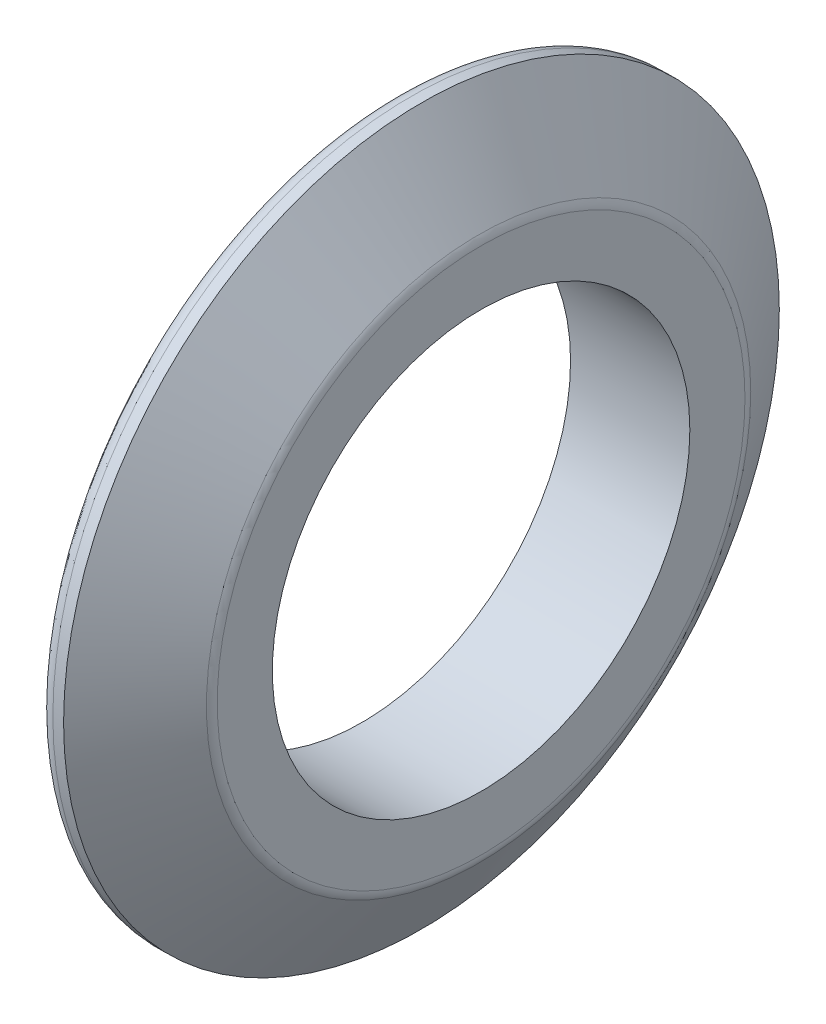
ISO-10303-21;
HEADER;
FILE_DESCRIPTION(('STEP AP214'),'2;1');
FILE_NAME('part.step','',(''),(''),'','','');
FILE_SCHEMA(('AUTOMOTIVE_DESIGN { 1 0 10303 214 1 1 1 1 }'));
ENDSEC;
DATA;
#1=APPLICATION_CONTEXT('core data for automotive mechanical design processes');
#2=APPLICATION_PROTOCOL_DEFINITION('international standard','automotive_design',2000,#1);
#3=PRODUCT_CONTEXT('',#1,'mechanical');
#4=PRODUCT('Part','Part','',(#3));
#5=PRODUCT_RELATED_PRODUCT_CATEGORY('part','',(#4));
#6=PRODUCT_DEFINITION_FORMATION('','',#4);
#7=PRODUCT_DEFINITION_CONTEXT('part definition',#1,'design');
#8=PRODUCT_DEFINITION('design','',#6,#7);
#9=PRODUCT_DEFINITION_SHAPE('','',#8);
#10=(LENGTH_UNIT() NAMED_UNIT(*) SI_UNIT(.MILLI.,.METRE.));
#11=(NAMED_UNIT(*) PLANE_ANGLE_UNIT() SI_UNIT($,.RADIAN.));
#12=(NAMED_UNIT(*) SI_UNIT($,.STERADIAN.) SOLID_ANGLE_UNIT());
#13=UNCERTAINTY_MEASURE_WITH_UNIT(LENGTH_MEASURE(1.E-05),#10,'distance_accuracy_value','');
#14=(GEOMETRIC_REPRESENTATION_CONTEXT(3) GLOBAL_UNCERTAINTY_ASSIGNED_CONTEXT((#13)) GLOBAL_UNIT_ASSIGNED_CONTEXT((#10,
#11,#12)) REPRESENTATION_CONTEXT('',''));
#15=CARTESIAN_POINT('',(0.,0.,0.));
#16=DIRECTION('',(0.,0.,1.));
#17=DIRECTION('',(1.,0.,0.));
#18=AXIS2_PLACEMENT_3D('',#15,#16,#17);
#19=CARTESIAN_POINT('',(0.,0.,0.));
#20=DIRECTION('',(1.,0.,0.));
#21=DIRECTION('',(0.,0.,-1.));
#22=AXIS2_PLACEMENT_3D('',#19,#20,#21);
#23=CYLINDRICAL_SURFACE('',#22,7.);
#24=CARTESIAN_POINT('',(0.,0.,0.));
#25=DIRECTION('',(1.,0.,0.));
#26=DIRECTION('',(0.,0.,-1.));
#27=AXIS2_PLACEMENT_3D('',#24,#25,#26);
#28=CIRCLE('',#27,7.);
#29=CARTESIAN_POINT('',(0.,0.,-7.));
#30=VERTEX_POINT('',#29);
#31=EDGE_CURVE('E10',#30,#30,#28,.T.);
#32=ORIENTED_EDGE('',*,*,#31,.T.);
#33=EDGE_LOOP('',(#32));
#34=FACE_BOUND('',#33,.T.);
#35=CARTESIAN_POINT('',(-4.,0.,0.));
#36=DIRECTION('',(1.,0.,0.));
#37=DIRECTION('',(0.,0.,-1.));
#38=AXIS2_PLACEMENT_3D('',#35,#36,#37);
#39=CIRCLE('',#38,7.);
#40=CARTESIAN_POINT('',(-4.,0.,-7.));
#41=VERTEX_POINT('',#40);
#42=EDGE_CURVE('E88',#41,#41,#39,.T.);
#43=ORIENTED_EDGE('',*,*,#42,.F.);
#44=EDGE_LOOP('',(#43));
#45=FACE_BOUND('',#44,.T.);
#46=ADVANCED_FACE('F41',(#34,#45),#23,.F.);
#47=CARTESIAN_POINT('',(0.,7.,0.));
#48=DIRECTION('',(1.,0.,0.));
#49=DIRECTION('',(0.,0.,-1.));
#50=AXIS2_PLACEMENT_3D('',#47,#48,#49);
#51=PLANE('',#50);
#52=CARTESIAN_POINT('',(0.,0.,0.));
#53=DIRECTION('',(1.,0.,0.));
#54=DIRECTION('',(0.,0.,-1.));
#55=AXIS2_PLACEMENT_3D('',#52,#53,#54);
#56=CIRCLE('',#55,8.848612181134);
#57=CARTESIAN_POINT('',(0.,0.,-8.848612181134));
#58=VERTEX_POINT('',#57);
#59=EDGE_CURVE('E48',#58,#58,#56,.T.);
#60=ORIENTED_EDGE('',*,*,#59,.T.);
#61=EDGE_LOOP('',(#60));
#62=FACE_BOUND('',#61,.T.);
#63=ORIENTED_EDGE('',*,*,#31,.F.);
#64=EDGE_LOOP('',(#63));
#65=FACE_BOUND('',#64,.T.);
#66=ADVANCED_FACE('F97',(#62,#65),#51,.T.);
#67=CARTESIAN_POINT('',(-0.5,0.,0.));
#68=DIRECTION('',(1.,0.,0.));
#69=DIRECTION('',(0.,0.,-1.));
#70=AXIS2_PLACEMENT_3D('',#67,#68,#69);
#71=TOROIDAL_SURFACE('',#70,8.848612181134,0.5);
#72=CARTESIAN_POINT('',(-0.0839748528310793,0.,0.));
#73=DIRECTION('',(1.,0.,0.));
#74=DIRECTION('',(0.,0.,-1.));
#75=AXIS2_PLACEMENT_3D('',#72,#73,#74);
#76=CIRCLE('',#75,9.12596227924662);
#77=CARTESIAN_POINT('',(-0.0839748528310793,0.,-9.12596227924662));
#78=VERTEX_POINT('',#77);
#79=EDGE_CURVE('E53',#78,#78,#76,.T.);
#80=ORIENTED_EDGE('',*,*,#79,.T.);
#81=EDGE_LOOP('',(#80));
#82=FACE_BOUND('',#81,.T.);
#83=ORIENTED_EDGE('',*,*,#59,.F.);
#84=EDGE_LOOP('',(#83));
#85=FACE_BOUND('',#84,.T.);
#86=ADVANCED_FACE('F101',(#82,#85),#71,.T.);
#87=CARTESIAN_POINT('',(-0.0839748528310793,0.,0.));
#88=DIRECTION('',(-1.,0.,0.));
#89=DIRECTION('',(0.,0.,1.));
#90=AXIS2_PLACEMENT_3D('',#87,#88,#89);
#91=CONICAL_SURFACE('',#90,9.12596227924662,0.982793723247329);
#92=CARTESIAN_POINT('',(-2.,0.,0.));
#93=DIRECTION('',(1.,0.,0.));
#94=DIRECTION('',(0.,0.,-1.));
#95=AXIS2_PLACEMENT_3D('',#92,#93,#94);
#96=CIRCLE('',#95,12.);
#97=CARTESIAN_POINT('',(-2.,0.,-12.));
#98=VERTEX_POINT('',#97);
#99=EDGE_CURVE('E58',#98,#98,#96,.T.);
#100=ORIENTED_EDGE('',*,*,#99,.T.);
#101=EDGE_LOOP('',(#100));
#102=FACE_BOUND('',#101,.T.);
#103=ORIENTED_EDGE('',*,*,#79,.F.);
#104=EDGE_LOOP('',(#103));
#105=FACE_BOUND('',#104,.T.);
#106=ADVANCED_FACE('F105',(#102,#105),#91,.T.);
#107=CARTESIAN_POINT('',(0.,0.,0.));
#108=DIRECTION('',(1.,0.,0.));
#109=DIRECTION('',(0.,0.,-1.));
#110=AXIS2_PLACEMENT_3D('',#107,#108,#109);
#111=CYLINDRICAL_SURFACE('',#110,12.);
#112=CARTESIAN_POINT('',(-2.35961179679779,0.,0.));
#113=DIRECTION('',(1.,0.,0.));
#114=DIRECTION('',(0.,0.,-1.));
#115=AXIS2_PLACEMENT_3D('',#112,#113,#114);
#116=CIRCLE('',#115,12.);
#117=CARTESIAN_POINT('',(-2.35961179679779,0.,-12.));
#118=VERTEX_POINT('',#117);
#119=EDGE_CURVE('E64',#118,#118,#116,.T.);
#120=ORIENTED_EDGE('',*,*,#119,.T.);
#121=EDGE_LOOP('',(#120));
#122=FACE_BOUND('',#121,.T.);
#123=ORIENTED_EDGE('',*,*,#99,.F.);
#124=EDGE_LOOP('',(#123));
#125=FACE_BOUND('',#124,.T.);
#126=ADVANCED_FACE('F112',(#122,#125),#111,.T.);
#127=CARTESIAN_POINT('',(-2.35961179679779,0.,0.));
#128=DIRECTION('',(1.,0.,0.));
#129=DIRECTION('',(0.,0.,-1.));
#130=AXIS2_PLACEMENT_3D('',#127,#128,#129);
#131=TOROIDAL_SURFACE('',#130,11.5,0.5);
#132=CARTESIAN_POINT('',(-2.84468304687046,0.,0.));
#133=DIRECTION('',(1.,0.,0.));
#134=DIRECTION('',(0.,0.,-1.));
#135=AXIS2_PLACEMENT_3D('',#132,#133,#134);
#136=CIRCLE('',#135,11.3787321874818);
#137=CARTESIAN_POINT('',(-2.84468304687046,0.,-11.3787321874818));
#138=VERTEX_POINT('',#137);
#139=EDGE_CURVE('E68',#138,#138,#136,.T.);
#140=ORIENTED_EDGE('',*,*,#139,.T.);
#141=EDGE_LOOP('',(#140));
#142=FACE_BOUND('',#141,.T.);
#143=ORIENTED_EDGE('',*,*,#119,.F.);
#144=EDGE_LOOP('',(#143));
#145=FACE_BOUND('',#144,.T.);
#146=ADVANCED_FACE('F116',(#142,#145),#131,.T.);
#147=CARTESIAN_POINT('',(-2.84468304687046,0.,0.));
#148=DIRECTION('',(-1.,0.,0.));
#149=DIRECTION('',(0.,0.,1.));
#150=AXIS2_PLACEMENT_3D('',#147,#148,#149);
#151=CONICAL_SURFACE('',#150,11.3787321874818,1.32581766366803);
#152=CARTESIAN_POINT('',(-2.15531695312954,0.,0.));
#153=DIRECTION('',(1.,0.,0.));
#154=DIRECTION('',(0.,0.,-1.));
#155=AXIS2_PLACEMENT_3D('',#152,#153,#154);
#156=CIRCLE('',#155,8.62126781251817);
#157=CARTESIAN_POINT('',(-2.15531695312954,0.,-8.62126781251817));
#158=VERTEX_POINT('',#157);
#159=EDGE_CURVE('E72',#158,#158,#156,.T.);
#160=ORIENTED_EDGE('',*,*,#159,.T.);
#161=EDGE_LOOP('',(#160));
#162=FACE_BOUND('',#161,.T.);
#163=ORIENTED_EDGE('',*,*,#139,.F.);
#164=EDGE_LOOP('',(#163));
#165=FACE_BOUND('',#164,.T.);
#166=ADVANCED_FACE('F120',(#162,#165),#151,.F.);
#167=CARTESIAN_POINT('',(-2.64038820320221,0.,0.));
#168=DIRECTION('',(1.,0.,0.));
#169=DIRECTION('',(0.,0.,-1.));
#170=AXIS2_PLACEMENT_3D('',#167,#168,#169);
#171=TOROIDAL_SURFACE('',#170,8.5,0.5);
#172=CARTESIAN_POINT('',(-2.64038820320221,0.,0.));
#173=DIRECTION('',(1.,0.,0.));
#174=DIRECTION('',(0.,0.,-1.));
#175=AXIS2_PLACEMENT_3D('',#172,#173,#174);
#176=CIRCLE('',#175,8.);
#177=CARTESIAN_POINT('',(-2.64038820320221,0.,-8.));
#178=VERTEX_POINT('',#177);
#179=EDGE_CURVE('E76',#178,#178,#176,.T.);
#180=ORIENTED_EDGE('',*,*,#179,.T.);
#181=EDGE_LOOP('',(#180));
#182=FACE_BOUND('',#181,.T.);
#183=ORIENTED_EDGE('',*,*,#159,.F.);
#184=EDGE_LOOP('',(#183));
#185=FACE_BOUND('',#184,.T.);
#186=ADVANCED_FACE('F124',(#182,#185),#171,.F.);
#187=CARTESIAN_POINT('',(0.,0.,0.));
#188=DIRECTION('',(1.,0.,0.));
#189=DIRECTION('',(0.,0.,-1.));
#190=AXIS2_PLACEMENT_3D('',#187,#188,#189);
#191=CYLINDRICAL_SURFACE('',#190,8.);
#192=CARTESIAN_POINT('',(-3.5,0.,0.));
#193=DIRECTION('',(1.,0.,0.));
#194=DIRECTION('',(0.,0.,-1.));
#195=AXIS2_PLACEMENT_3D('',#192,#193,#194);
#196=CIRCLE('',#195,8.);
#197=CARTESIAN_POINT('',(-3.5,0.,-8.));
#198=VERTEX_POINT('',#197);
#199=EDGE_CURVE('E80',#198,#198,#196,.T.);
#200=ORIENTED_EDGE('',*,*,#199,.T.);
#201=EDGE_LOOP('',(#200));
#202=FACE_BOUND('',#201,.T.);
#203=ORIENTED_EDGE('',*,*,#179,.F.);
#204=EDGE_LOOP('',(#203));
#205=FACE_BOUND('',#204,.T.);
#206=ADVANCED_FACE('F128',(#202,#205),#191,.T.);
#207=CARTESIAN_POINT('',(-3.5,0.,0.));
#208=DIRECTION('',(1.,0.,0.));
#209=DIRECTION('',(0.,0.,-1.));
#210=AXIS2_PLACEMENT_3D('',#207,#208,#209);
#211=TOROIDAL_SURFACE('',#210,7.5,0.5);
#212=CARTESIAN_POINT('',(-4.,0.,0.));
#213=DIRECTION('',(1.,0.,0.));
#214=DIRECTION('',(0.,0.,-1.));
#215=AXIS2_PLACEMENT_3D('',#212,#213,#214);
#216=CIRCLE('',#215,7.5);
#217=CARTESIAN_POINT('',(-4.,0.,-7.5));
#218=VERTEX_POINT('',#217);
#219=EDGE_CURVE('E84',#218,#218,#216,.T.);
#220=ORIENTED_EDGE('',*,*,#219,.T.);
#221=EDGE_LOOP('',(#220));
#222=FACE_BOUND('',#221,.T.);
#223=ORIENTED_EDGE('',*,*,#199,.F.);
#224=EDGE_LOOP('',(#223));
#225=FACE_BOUND('',#224,.T.);
#226=ADVANCED_FACE('F132',(#222,#225),#211,.T.);
#227=CARTESIAN_POINT('',(-4.,7.5,0.));
#228=DIRECTION('',(-1.,0.,0.));
#229=DIRECTION('',(0.,0.,1.));
#230=AXIS2_PLACEMENT_3D('',#227,#228,#229);
#231=PLANE('',#230);
#232=ORIENTED_EDGE('',*,*,#42,.T.);
#233=EDGE_LOOP('',(#232));
#234=FACE_BOUND('',#233,.T.);
#235=ORIENTED_EDGE('',*,*,#219,.F.);
#236=EDGE_LOOP('',(#235));
#237=FACE_BOUND('',#236,.T.);
#238=ADVANCED_FACE('F93',(#234,#237),#231,.T.);
#239=CLOSED_SHELL('',(#46,#66,#86,#106,#126,#146,#166,#186,#206,#226,#238));
#240=MANIFOLD_SOLID_BREP('B2',#239);
#241=ADVANCED_BREP_SHAPE_REPRESENTATION('',(#18,#240),#14);
#242=SHAPE_DEFINITION_REPRESENTATION(#9,#241);
ENDSEC;
END-ISO-10303-21;
